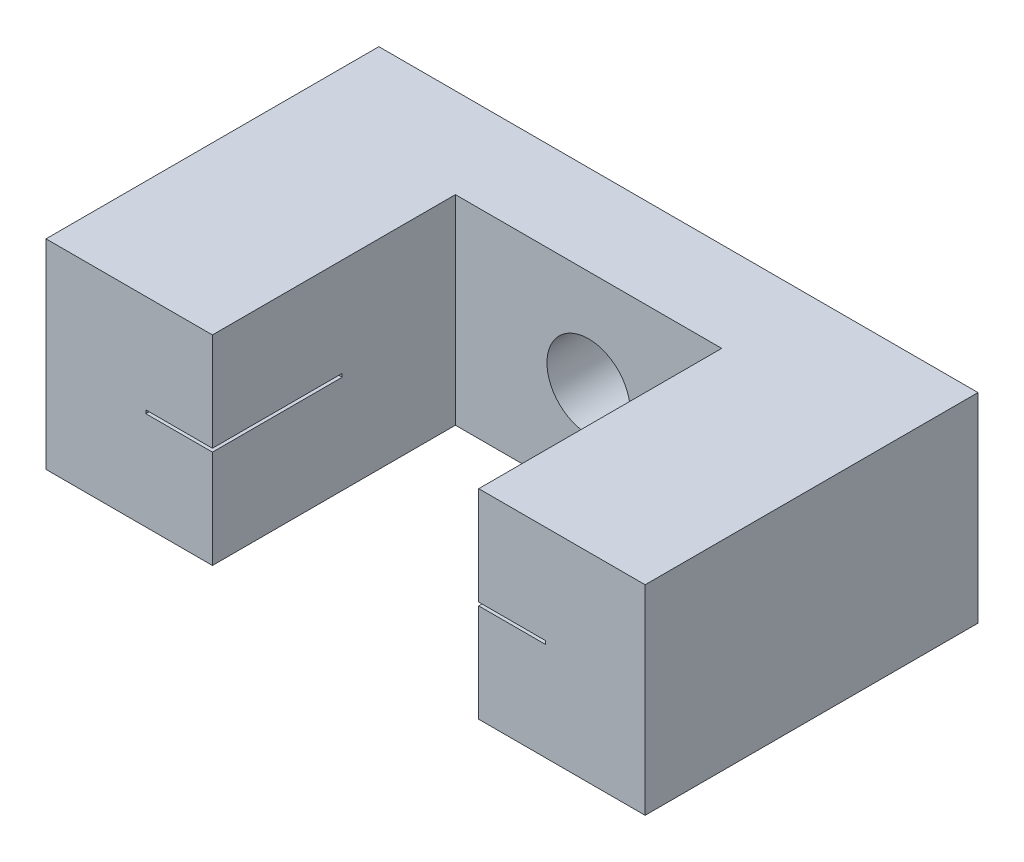
ISO-10303-21;
HEADER;
FILE_DESCRIPTION(('STEP AP214'),'2;1');
FILE_NAME('part.step','',(''),(''),'','','');
FILE_SCHEMA(('AUTOMOTIVE_DESIGN { 1 0 10303 214 1 1 1 1 }'));
ENDSEC;
DATA;
#1=APPLICATION_CONTEXT('core data for automotive mechanical design processes');
#2=APPLICATION_PROTOCOL_DEFINITION('international standard','automotive_design',2000,#1);
#3=PRODUCT_CONTEXT('',#1,'mechanical');
#4=PRODUCT('Part','Part','',(#3));
#5=PRODUCT_RELATED_PRODUCT_CATEGORY('part','',(#4));
#6=PRODUCT_DEFINITION_FORMATION('','',#4);
#7=PRODUCT_DEFINITION_CONTEXT('part definition',#1,'design');
#8=PRODUCT_DEFINITION('design','',#6,#7);
#9=PRODUCT_DEFINITION_SHAPE('','',#8);
#10=(LENGTH_UNIT() NAMED_UNIT(*) SI_UNIT(.MILLI.,.METRE.));
#11=(NAMED_UNIT(*) PLANE_ANGLE_UNIT() SI_UNIT($,.RADIAN.));
#12=(NAMED_UNIT(*) SI_UNIT($,.STERADIAN.) SOLID_ANGLE_UNIT());
#13=UNCERTAINTY_MEASURE_WITH_UNIT(LENGTH_MEASURE(1.E-05),#10,'distance_accuracy_value','');
#14=(GEOMETRIC_REPRESENTATION_CONTEXT(3) GLOBAL_UNCERTAINTY_ASSIGNED_CONTEXT((#13)) GLOBAL_UNIT_ASSIGNED_CONTEXT((#10,
#11,#12)) REPRESENTATION_CONTEXT('',''));
#15=CARTESIAN_POINT('',(0.,0.,0.));
#16=DIRECTION('',(0.,0.,1.));
#17=DIRECTION('',(1.,0.,0.));
#18=AXIS2_PLACEMENT_3D('',#15,#16,#17);
#19=CARTESIAN_POINT('',(0.,6.,0.));
#20=DIRECTION('',(0.,0.,-1.));
#21=DIRECTION('',(-1.,0.,0.));
#22=AXIS2_PLACEMENT_3D('',#19,#20,#21);
#23=PLANE('',#22);
#24=DIRECTION('',(0.,-1.,0.));
#25=VECTOR('',#24,1.);
#26=CARTESIAN_POINT('',(3.5,4.,0.));
#27=LINE('',#26,#25);
#28=CARTESIAN_POINT('',(3.5,4.,0.));
#29=VERTEX_POINT('',#28);
#30=CARTESIAN_POINT('',(3.5,2.,0.));
#31=VERTEX_POINT('',#30);
#32=EDGE_CURVE('E266',#29,#31,#27,.T.);
#33=ORIENTED_EDGE('',*,*,#32,.F.);
#34=DIRECTION('',(1.,0.,0.));
#35=VECTOR('',#34,1.);
#36=CARTESIAN_POINT('',(3.5,4.,0.));
#37=LINE('',#36,#35);
#38=CARTESIAN_POINT('',(1.5,4.,0.));
#39=VERTEX_POINT('',#38);
#40=EDGE_CURVE('E288',#39,#29,#37,.T.);
#41=ORIENTED_EDGE('',*,*,#40,.F.);
#42=DIRECTION('',(0.,1.,0.));
#43=VECTOR('',#42,1.);
#44=CARTESIAN_POINT('',(1.5,4.,0.));
#45=LINE('',#44,#43);
#46=CARTESIAN_POINT('',(1.5,2.,0.));
#47=VERTEX_POINT('',#46);
#48=EDGE_CURVE('E285',#47,#39,#45,.T.);
#49=ORIENTED_EDGE('',*,*,#48,.F.);
#50=DIRECTION('',(-1.,0.,0.));
#51=VECTOR('',#50,1.);
#52=CARTESIAN_POINT('',(3.5,2.,0.));
#53=LINE('',#52,#51);
#54=EDGE_CURVE('E282',#31,#47,#53,.T.);
#55=ORIENTED_EDGE('',*,*,#54,.F.);
#56=EDGE_LOOP('',(#33,#41,#49,#55));
#57=FACE_BOUND('',#56,.T.);
#58=CARTESIAN_POINT('',(9.,3.,0.));
#59=DIRECTION('',(0.,0.,-1.));
#60=DIRECTION('',(-1.,0.,0.));
#61=AXIS2_PLACEMENT_3D('',#58,#59,#60);
#62=CIRCLE('',#61,1.25);
#63=CARTESIAN_POINT('',(7.75,3.,0.));
#64=VERTEX_POINT('',#63);
#65=EDGE_CURVE('E365',#64,#64,#62,.F.);
#66=ORIENTED_EDGE('',*,*,#65,.T.);
#67=EDGE_LOOP('',(#66));
#68=FACE_BOUND('',#67,.T.);
#69=DIRECTION('',(1.,0.,0.));
#70=VECTOR('',#69,1.);
#71=CARTESIAN_POINT('',(0.,0.,0.));
#72=LINE('',#71,#70);
#73=CARTESIAN_POINT('',(0.,0.,0.));
#74=VERTEX_POINT('',#73);
#75=CARTESIAN_POINT('',(18.,0.,0.));
#76=VERTEX_POINT('',#75);
#77=EDGE_CURVE('E397',#74,#76,#72,.T.);
#78=ORIENTED_EDGE('',*,*,#77,.F.);
#79=DIRECTION('',(0.,-1.,0.));
#80=VECTOR('',#79,1.);
#81=CARTESIAN_POINT('',(0.,6.,0.));
#82=LINE('',#81,#80);
#83=CARTESIAN_POINT('',(0.,6.,0.));
#84=VERTEX_POINT('',#83);
#85=EDGE_CURVE('E394',#84,#74,#82,.T.);
#86=ORIENTED_EDGE('',*,*,#85,.F.);
#87=DIRECTION('',(1.,0.,0.));
#88=VECTOR('',#87,1.);
#89=CARTESIAN_POINT('',(0.,6.,0.));
#90=LINE('',#89,#88);
#91=CARTESIAN_POINT('',(18.,6.,0.));
#92=VERTEX_POINT('',#91);
#93=EDGE_CURVE('E372',#84,#92,#90,.T.);
#94=ORIENTED_EDGE('',*,*,#93,.T.);
#95=DIRECTION('',(0.,-1.,0.));
#96=VECTOR('',#95,1.);
#97=CARTESIAN_POINT('',(18.,6.,0.));
#98=LINE('',#97,#96);
#99=EDGE_CURVE('E434',#92,#76,#98,.T.);
#100=ORIENTED_EDGE('',*,*,#99,.T.);
#101=EDGE_LOOP('',(#78,#86,#94,#100));
#102=FACE_BOUND('',#101,.T.);
#103=DIRECTION('',(-1.,0.,0.));
#104=VECTOR('',#103,1.);
#105=CARTESIAN_POINT('',(14.5,4.,0.));
#106=LINE('',#105,#104);
#107=CARTESIAN_POINT('',(16.5,4.,0.));
#108=VERTEX_POINT('',#107);
#109=CARTESIAN_POINT('',(14.5,4.,0.));
#110=VERTEX_POINT('',#109);
#111=EDGE_CURVE('E247',#108,#110,#106,.T.);
#112=ORIENTED_EDGE('',*,*,#111,.T.);
#113=DIRECTION('',(0.,-1.,0.));
#114=VECTOR('',#113,1.);
#115=CARTESIAN_POINT('',(14.5,4.,0.));
#116=LINE('',#115,#114);
#117=CARTESIAN_POINT('',(14.5,2.,0.));
#118=VERTEX_POINT('',#117);
#119=EDGE_CURVE('E49',#110,#118,#116,.T.);
#120=ORIENTED_EDGE('',*,*,#119,.T.);
#121=DIRECTION('',(1.,0.,0.));
#122=VECTOR('',#121,1.);
#123=CARTESIAN_POINT('',(14.5,2.,0.));
#124=LINE('',#123,#122);
#125=CARTESIAN_POINT('',(16.5,2.,0.));
#126=VERTEX_POINT('',#125);
#127=EDGE_CURVE('E242',#118,#126,#124,.T.);
#128=ORIENTED_EDGE('',*,*,#127,.T.);
#129=DIRECTION('',(0.,1.,0.));
#130=VECTOR('',#129,1.);
#131=CARTESIAN_POINT('',(16.5,4.,0.));
#132=LINE('',#131,#130);
#133=EDGE_CURVE('E249',#126,#108,#132,.T.);
#134=ORIENTED_EDGE('',*,*,#133,.T.);
#135=EDGE_LOOP('',(#112,#120,#128,#134));
#136=FACE_BOUND('',#135,.T.);
#137=ADVANCED_FACE('F34',(#57,#68,#102,#136),#23,.T.);
#138=CARTESIAN_POINT('',(15.,2.95,10.));
#139=DIRECTION('',(0.,1.,0.));
#140=DIRECTION('',(0.,0.,1.));
#141=AXIS2_PLACEMENT_3D('',#138,#139,#140);
#142=PLANE('',#141);
#143=DIRECTION('',(-1.,0.,0.));
#144=VECTOR('',#143,1.);
#145=CARTESIAN_POINT('',(15.,2.95,8.));
#146=LINE('',#145,#144);
#147=CARTESIAN_POINT('',(15.,2.95,8.));
#148=VERTEX_POINT('',#147);
#149=CARTESIAN_POINT('',(14.5,2.95,8.));
#150=VERTEX_POINT('',#149);
#151=EDGE_CURVE('E57',#148,#150,#146,.T.);
#152=ORIENTED_EDGE('',*,*,#151,.T.);
#153=DIRECTION('',(0.,0.,-1.));
#154=VECTOR('',#153,1.);
#155=CARTESIAN_POINT('',(14.5,2.95,10.));
#156=LINE('',#155,#154);
#157=CARTESIAN_POINT('',(14.5,2.95,6.1));
#158=VERTEX_POINT('',#157);
#159=EDGE_CURVE('E263',#150,#158,#156,.T.);
#160=ORIENTED_EDGE('',*,*,#159,.T.);
#161=DIRECTION('',(-1.,0.,0.));
#162=VECTOR('',#161,1.);
#163=CARTESIAN_POINT('',(15.,2.95,6.1));
#164=LINE('',#163,#162);
#165=CARTESIAN_POINT('',(13.,2.95,6.1));
#166=VERTEX_POINT('',#165);
#167=EDGE_CURVE('E331',#158,#166,#164,.T.);
#168=ORIENTED_EDGE('',*,*,#167,.T.);
#169=DIRECTION('',(0.,0.,-1.));
#170=VECTOR('',#169,1.);
#171=CARTESIAN_POINT('',(13.,2.95,10.));
#172=LINE('',#171,#170);
#173=CARTESIAN_POINT('',(13.,2.95,10.));
#174=VERTEX_POINT('',#173);
#175=EDGE_CURVE('E313',#174,#166,#172,.T.);
#176=ORIENTED_EDGE('',*,*,#175,.F.);
#177=DIRECTION('',(-1.,0.,0.));
#178=VECTOR('',#177,1.);
#179=CARTESIAN_POINT('',(15.,2.95,10.));
#180=LINE('',#179,#178);
#181=CARTESIAN_POINT('',(15.,2.95,10.));
#182=VERTEX_POINT('',#181);
#183=EDGE_CURVE('E327',#182,#174,#180,.T.);
#184=ORIENTED_EDGE('',*,*,#183,.F.);
#185=DIRECTION('',(0.,0.,-1.));
#186=VECTOR('',#185,1.);
#187=CARTESIAN_POINT('',(15.,2.95,10.));
#188=LINE('',#187,#186);
#189=EDGE_CURVE('E316',#182,#148,#188,.T.);
#190=ORIENTED_EDGE('',*,*,#189,.T.);
#191=EDGE_LOOP('',(#152,#160,#168,#176,#184,#190));
#192=FACE_BOUND('',#191,.T.);
#193=ADVANCED_FACE('F446',(#192),#142,.T.);
#194=CARTESIAN_POINT('',(15.,3.05,6.1));
#195=DIRECTION('',(0.,0.,-1.));
#196=DIRECTION('',(-1.,0.,0.));
#197=AXIS2_PLACEMENT_3D('',#194,#195,#196);
#198=PLANE('',#197);
#199=DIRECTION('',(0.,-1.,0.));
#200=VECTOR('',#199,1.);
#201=CARTESIAN_POINT('',(14.5,3.05,6.1));
#202=LINE('',#201,#200);
#203=CARTESIAN_POINT('',(14.5,3.05,6.1));
#204=VERTEX_POINT('',#203);
#205=EDGE_CURVE('E261',#204,#158,#202,.T.);
#206=ORIENTED_EDGE('',*,*,#205,.F.);
#207=DIRECTION('',(-1.,0.,0.));
#208=VECTOR('',#207,1.);
#209=CARTESIAN_POINT('',(15.,3.05,6.1));
#210=LINE('',#209,#208);
#211=CARTESIAN_POINT('',(13.,3.05,6.1));
#212=VERTEX_POINT('',#211);
#213=EDGE_CURVE('E333',#204,#212,#210,.T.);
#214=ORIENTED_EDGE('',*,*,#213,.T.);
#215=DIRECTION('',(0.,-1.,0.));
#216=VECTOR('',#215,1.);
#217=CARTESIAN_POINT('',(13.,3.05,6.1));
#218=LINE('',#217,#216);
#219=EDGE_CURVE('E322',#212,#166,#218,.T.);
#220=ORIENTED_EDGE('',*,*,#219,.T.);
#221=ORIENTED_EDGE('',*,*,#167,.F.);
#222=EDGE_LOOP('',(#206,#214,#220,#221));
#223=FACE_BOUND('',#222,.T.);
#224=ADVANCED_FACE('F538',(#223),#198,.F.);
#225=CARTESIAN_POINT('',(15.,3.05,10.));
#226=DIRECTION('',(0.,1.,0.));
#227=DIRECTION('',(0.,0.,1.));
#228=AXIS2_PLACEMENT_3D('',#225,#226,#227);
#229=PLANE('',#228);
#230=DIRECTION('',(0.,0.,-1.));
#231=VECTOR('',#230,1.);
#232=CARTESIAN_POINT('',(14.5,3.05,10.));
#233=LINE('',#232,#231);
#234=CARTESIAN_POINT('',(14.5,3.05,8.));
#235=VERTEX_POINT('',#234);
#236=EDGE_CURVE('E11',#235,#204,#233,.T.);
#237=ORIENTED_EDGE('',*,*,#236,.F.);
#238=DIRECTION('',(-1.,0.,0.));
#239=VECTOR('',#238,1.);
#240=CARTESIAN_POINT('',(15.,3.05,8.));
#241=LINE('',#240,#239);
#242=CARTESIAN_POINT('',(15.,3.05,8.));
#243=VERTEX_POINT('',#242);
#244=EDGE_CURVE('E239',#243,#235,#241,.T.);
#245=ORIENTED_EDGE('',*,*,#244,.F.);
#246=DIRECTION('',(0.,0.,-1.));
#247=VECTOR('',#246,1.);
#248=CARTESIAN_POINT('',(15.,3.05,10.));
#249=LINE('',#248,#247);
#250=CARTESIAN_POINT('',(15.,3.05,10.));
#251=VERTEX_POINT('',#250);
#252=EDGE_CURVE('E312',#251,#243,#249,.T.);
#253=ORIENTED_EDGE('',*,*,#252,.F.);
#254=DIRECTION('',(-1.,0.,0.));
#255=VECTOR('',#254,1.);
#256=CARTESIAN_POINT('',(15.,3.05,10.));
#257=LINE('',#256,#255);
#258=CARTESIAN_POINT('',(13.,3.05,10.));
#259=VERTEX_POINT('',#258);
#260=EDGE_CURVE('E319',#251,#259,#257,.T.);
#261=ORIENTED_EDGE('',*,*,#260,.T.);
#262=DIRECTION('',(0.,0.,-1.));
#263=VECTOR('',#262,1.);
#264=CARTESIAN_POINT('',(13.,3.05,10.));
#265=LINE('',#264,#263);
#266=EDGE_CURVE('E308',#259,#212,#265,.T.);
#267=ORIENTED_EDGE('',*,*,#266,.T.);
#268=ORIENTED_EDGE('',*,*,#213,.F.);
#269=EDGE_LOOP('',(#237,#245,#253,#261,#267,#268));
#270=FACE_BOUND('',#269,.T.);
#271=ADVANCED_FACE('F570',(#270),#229,.F.);
#272=CARTESIAN_POINT('',(15.,0.,0.));
#273=DIRECTION('',(-1.,0.,0.));
#274=DIRECTION('',(0.,0.,-1.));
#275=AXIS2_PLACEMENT_3D('',#272,#273,#274);
#276=PLANE('',#275);
#277=ORIENTED_EDGE('',*,*,#252,.T.);
#278=DIRECTION('',(0.,-1.,0.));
#279=VECTOR('',#278,1.);
#280=CARTESIAN_POINT('',(15.,0.,8.));
#281=LINE('',#280,#279);
#282=EDGE_CURVE('E42',#243,#148,#281,.T.);
#283=ORIENTED_EDGE('',*,*,#282,.T.);
#284=ORIENTED_EDGE('',*,*,#189,.F.);
#285=DIRECTION('',(0.,-1.,0.));
#286=VECTOR('',#285,1.);
#287=CARTESIAN_POINT('',(15.,3.05,10.));
#288=LINE('',#287,#286);
#289=EDGE_CURVE('E309',#251,#182,#288,.T.);
#290=ORIENTED_EDGE('',*,*,#289,.F.);
#291=EDGE_LOOP('',(#277,#283,#284,#290));
#292=FACE_BOUND('',#291,.T.);
#293=ADVANCED_FACE('F443',(#292),#276,.T.);
#294=CARTESIAN_POINT('',(3.,0.,0.));
#295=DIRECTION('',(1.,0.,0.));
#296=DIRECTION('',(0.,0.,-1.));
#297=AXIS2_PLACEMENT_3D('',#294,#295,#296);
#298=PLANE('',#297);
#299=DIRECTION('',(0.,0.,-1.));
#300=VECTOR('',#299,1.);
#301=CARTESIAN_POINT('',(3.,2.95,10.));
#302=LINE('',#301,#300);
#303=CARTESIAN_POINT('',(3.,2.95,10.));
#304=VERTEX_POINT('',#303);
#305=CARTESIAN_POINT('',(3.,2.95,8.));
#306=VERTEX_POINT('',#305);
#307=EDGE_CURVE('E339',#304,#306,#302,.T.);
#308=ORIENTED_EDGE('',*,*,#307,.T.);
#309=DIRECTION('',(0.,1.,0.));
#310=VECTOR('',#309,1.);
#311=CARTESIAN_POINT('',(3.,0.,8.));
#312=LINE('',#311,#310);
#313=CARTESIAN_POINT('',(3.,3.05,8.));
#314=VERTEX_POINT('',#313);
#315=EDGE_CURVE('E419',#306,#314,#312,.T.);
#316=ORIENTED_EDGE('',*,*,#315,.T.);
#317=DIRECTION('',(0.,0.,-1.));
#318=VECTOR('',#317,1.);
#319=CARTESIAN_POINT('',(3.,3.05,10.));
#320=LINE('',#319,#318);
#321=CARTESIAN_POINT('',(3.,3.05,10.));
#322=VERTEX_POINT('',#321);
#323=EDGE_CURVE('E343',#322,#314,#320,.T.);
#324=ORIENTED_EDGE('',*,*,#323,.F.);
#325=DIRECTION('',(0.,-1.,0.));
#326=VECTOR('',#325,1.);
#327=CARTESIAN_POINT('',(3.,3.05,10.));
#328=LINE('',#327,#326);
#329=EDGE_CURVE('E336',#322,#304,#328,.T.);
#330=ORIENTED_EDGE('',*,*,#329,.T.);
#331=EDGE_LOOP('',(#308,#316,#324,#330));
#332=FACE_BOUND('',#331,.T.);
#333=ADVANCED_FACE('F495',(#332),#298,.T.);
#334=CARTESIAN_POINT('',(13.,6.,10.));
#335=DIRECTION('',(-1.,0.,0.));
#336=DIRECTION('',(0.,0.,1.));
#337=AXIS2_PLACEMENT_3D('',#334,#335,#336);
#338=PLANE('',#337);
#339=DIRECTION('',(0.,-1.,0.));
#340=VECTOR('',#339,1.);
#341=CARTESIAN_POINT('',(13.,6.,10.));
#342=LINE('',#341,#340);
#343=CARTESIAN_POINT('',(13.,0.,10.));
#344=VERTEX_POINT('',#343);
#345=EDGE_CURVE('E431',#174,#344,#342,.T.);
#346=ORIENTED_EDGE('',*,*,#345,.F.);
#347=ORIENTED_EDGE('',*,*,#175,.T.);
#348=ORIENTED_EDGE('',*,*,#219,.F.);
#349=ORIENTED_EDGE('',*,*,#266,.F.);
#350=CARTESIAN_POINT('',(13.,6.,10.));
#351=VERTEX_POINT('',#350);
#352=EDGE_CURVE('E428',#351,#259,#342,.T.);
#353=ORIENTED_EDGE('',*,*,#352,.F.);
#354=DIRECTION('',(0.,0.,-1.));
#355=VECTOR('',#354,1.);
#356=CARTESIAN_POINT('',(13.,6.,10.));
#357=LINE('',#356,#355);
#358=CARTESIAN_POINT('',(13.,6.,2.7));
#359=VERTEX_POINT('',#358);
#360=EDGE_CURVE('E382',#351,#359,#357,.T.);
#361=ORIENTED_EDGE('',*,*,#360,.T.);
#362=DIRECTION('',(0.,-1.,0.));
#363=VECTOR('',#362,1.);
#364=CARTESIAN_POINT('',(13.,6.,2.7));
#365=LINE('',#364,#363);
#366=CARTESIAN_POINT('',(13.,0.,2.7));
#367=VERTEX_POINT('',#366);
#368=EDGE_CURVE('E426',#359,#367,#365,.T.);
#369=ORIENTED_EDGE('',*,*,#368,.T.);
#370=DIRECTION('',(0.,0.,-1.));
#371=VECTOR('',#370,1.);
#372=CARTESIAN_POINT('',(13.,0.,10.));
#373=LINE('',#372,#371);
#374=EDGE_CURVE('E406',#344,#367,#373,.T.);
#375=ORIENTED_EDGE('',*,*,#374,.F.);
#376=EDGE_LOOP('',(#346,#347,#348,#349,#353,#361,#369,#375));
#377=FACE_BOUND('',#376,.T.);
#378=ADVANCED_FACE('F454',(#377),#338,.T.);
#379=CARTESIAN_POINT('',(18.,6.,10.));
#380=DIRECTION('',(0.,0.,1.));
#381=DIRECTION('',(1.,0.,0.));
#382=AXIS2_PLACEMENT_3D('',#379,#380,#381);
#383=PLANE('',#382);
#384=ORIENTED_EDGE('',*,*,#289,.T.);
#385=ORIENTED_EDGE('',*,*,#183,.T.);
#386=ORIENTED_EDGE('',*,*,#345,.T.);
#387=DIRECTION('',(-1.,0.,0.));
#388=VECTOR('',#387,1.);
#389=CARTESIAN_POINT('',(18.,0.,10.));
#390=LINE('',#389,#388);
#391=CARTESIAN_POINT('',(18.,0.,10.));
#392=VERTEX_POINT('',#391);
#393=EDGE_CURVE('E403',#392,#344,#390,.T.);
#394=ORIENTED_EDGE('',*,*,#393,.F.);
#395=DIRECTION('',(0.,-1.,0.));
#396=VECTOR('',#395,1.);
#397=CARTESIAN_POINT('',(18.,6.,10.));
#398=LINE('',#397,#396);
#399=CARTESIAN_POINT('',(18.,6.,10.));
#400=VERTEX_POINT('',#399);
#401=EDGE_CURVE('E432',#400,#392,#398,.T.);
#402=ORIENTED_EDGE('',*,*,#401,.F.);
#403=DIRECTION('',(-1.,0.,0.));
#404=VECTOR('',#403,1.);
#405=CARTESIAN_POINT('',(18.,6.,10.));
#406=LINE('',#405,#404);
#407=EDGE_CURVE('E379',#400,#351,#406,.T.);
#408=ORIENTED_EDGE('',*,*,#407,.T.);
#409=ORIENTED_EDGE('',*,*,#352,.T.);
#410=ORIENTED_EDGE('',*,*,#260,.F.);
#411=EDGE_LOOP('',(#384,#385,#386,#394,#402,#408,#409,#410));
#412=FACE_BOUND('',#411,.T.);
#413=ADVANCED_FACE('F449',(#412),#383,.T.);
#414=CARTESIAN_POINT('',(5.,6.,10.));
#415=DIRECTION('',(0.,0.,1.));
#416=DIRECTION('',(1.,0.,0.));
#417=AXIS2_PLACEMENT_3D('',#414,#415,#416);
#418=PLANE('',#417);
#419=ORIENTED_EDGE('',*,*,#329,.F.);
#420=DIRECTION('',(1.,0.,0.));
#421=VECTOR('',#420,1.);
#422=CARTESIAN_POINT('',(3.,3.05,10.));
#423=LINE('',#422,#421);
#424=CARTESIAN_POINT('',(5.,3.05,10.));
#425=VERTEX_POINT('',#424);
#426=EDGE_CURVE('E354',#322,#425,#423,.T.);
#427=ORIENTED_EDGE('',*,*,#426,.T.);
#428=DIRECTION('',(0.,-1.,0.));
#429=VECTOR('',#428,1.);
#430=CARTESIAN_POINT('',(5.,6.,10.));
#431=LINE('',#430,#429);
#432=CARTESIAN_POINT('',(5.,6.,10.));
#433=VERTEX_POINT('',#432);
#434=EDGE_CURVE('E420',#433,#425,#431,.T.);
#435=ORIENTED_EDGE('',*,*,#434,.F.);
#436=DIRECTION('',(-1.,0.,0.));
#437=VECTOR('',#436,1.);
#438=CARTESIAN_POINT('',(5.,6.,10.));
#439=LINE('',#438,#437);
#440=CARTESIAN_POINT('',(0.,6.,10.));
#441=VERTEX_POINT('',#440);
#442=EDGE_CURVE('E391',#433,#441,#439,.T.);
#443=ORIENTED_EDGE('',*,*,#442,.T.);
#444=DIRECTION('',(0.,-1.,0.));
#445=VECTOR('',#444,1.);
#446=CARTESIAN_POINT('',(0.,6.,10.));
#447=LINE('',#446,#445);
#448=CARTESIAN_POINT('',(0.,0.,10.));
#449=VERTEX_POINT('',#448);
#450=EDGE_CURVE('E417',#441,#449,#447,.T.);
#451=ORIENTED_EDGE('',*,*,#450,.T.);
#452=DIRECTION('',(-1.,0.,0.));
#453=VECTOR('',#452,1.);
#454=CARTESIAN_POINT('',(5.,0.,10.));
#455=LINE('',#454,#453);
#456=CARTESIAN_POINT('',(5.,0.,10.));
#457=VERTEX_POINT('',#456);
#458=EDGE_CURVE('E373',#457,#449,#455,.T.);
#459=ORIENTED_EDGE('',*,*,#458,.F.);
#460=CARTESIAN_POINT('',(5.,2.95,10.));
#461=VERTEX_POINT('',#460);
#462=EDGE_CURVE('E423',#461,#457,#431,.T.);
#463=ORIENTED_EDGE('',*,*,#462,.F.);
#464=DIRECTION('',(1.,0.,0.));
#465=VECTOR('',#464,1.);
#466=CARTESIAN_POINT('',(3.,2.95,10.));
#467=LINE('',#466,#465);
#468=EDGE_CURVE('E346',#304,#461,#467,.T.);
#469=ORIENTED_EDGE('',*,*,#468,.F.);
#470=EDGE_LOOP('',(#419,#427,#435,#443,#451,#459,#463,#469));
#471=FACE_BOUND('',#470,.T.);
#472=ADVANCED_FACE('F479',(#471),#418,.T.);
#473=CARTESIAN_POINT('',(5.,6.,2.7));
#474=DIRECTION('',(1.,0.,0.));
#475=DIRECTION('',(0.,0.,-1.));
#476=AXIS2_PLACEMENT_3D('',#473,#474,#475);
#477=PLANE('',#476);
#478=ORIENTED_EDGE('',*,*,#434,.T.);
#479=DIRECTION('',(0.,0.,-1.));
#480=VECTOR('',#479,1.);
#481=CARTESIAN_POINT('',(5.,3.05,10.));
#482=LINE('',#481,#480);
#483=CARTESIAN_POINT('',(5.,3.05,6.1));
#484=VERTEX_POINT('',#483);
#485=EDGE_CURVE('E340',#425,#484,#482,.T.);
#486=ORIENTED_EDGE('',*,*,#485,.T.);
#487=DIRECTION('',(0.,-1.,0.));
#488=VECTOR('',#487,1.);
#489=CARTESIAN_POINT('',(5.,3.05,6.1));
#490=LINE('',#489,#488);
#491=CARTESIAN_POINT('',(5.,2.95,6.1));
#492=VERTEX_POINT('',#491);
#493=EDGE_CURVE('E349',#484,#492,#490,.T.);
#494=ORIENTED_EDGE('',*,*,#493,.T.);
#495=DIRECTION('',(0.,0.,-1.));
#496=VECTOR('',#495,1.);
#497=CARTESIAN_POINT('',(5.,2.95,10.));
#498=LINE('',#497,#496);
#499=EDGE_CURVE('E330',#461,#492,#498,.T.);
#500=ORIENTED_EDGE('',*,*,#499,.F.);
#501=ORIENTED_EDGE('',*,*,#462,.T.);
#502=DIRECTION('',(0.,0.,1.));
#503=VECTOR('',#502,1.);
#504=CARTESIAN_POINT('',(5.,0.,2.7));
#505=LINE('',#504,#503);
#506=CARTESIAN_POINT('',(5.,0.,2.7));
#507=VERTEX_POINT('',#506);
#508=EDGE_CURVE('E412',#507,#457,#505,.T.);
#509=ORIENTED_EDGE('',*,*,#508,.F.);
#510=DIRECTION('',(0.,-1.,0.));
#511=VECTOR('',#510,1.);
#512=CARTESIAN_POINT('',(5.,6.,2.7));
#513=LINE('',#512,#511);
#514=CARTESIAN_POINT('',(5.,6.,2.7));
#515=VERTEX_POINT('',#514);
#516=EDGE_CURVE('E424',#515,#507,#513,.T.);
#517=ORIENTED_EDGE('',*,*,#516,.F.);
#518=DIRECTION('',(0.,0.,1.));
#519=VECTOR('',#518,1.);
#520=CARTESIAN_POINT('',(5.,6.,2.7));
#521=LINE('',#520,#519);
#522=EDGE_CURVE('E388',#515,#433,#521,.T.);
#523=ORIENTED_EDGE('',*,*,#522,.T.);
#524=EDGE_LOOP('',(#478,#486,#494,#500,#501,#509,#517,#523));
#525=FACE_BOUND('',#524,.T.);
#526=ADVANCED_FACE('F486',(#525),#477,.T.);
#527=CARTESIAN_POINT('',(0.,6.,10.));
#528=DIRECTION('',(-1.,0.,0.));
#529=DIRECTION('',(0.,0.,1.));
#530=AXIS2_PLACEMENT_3D('',#527,#528,#529);
#531=PLANE('',#530);
#532=DIRECTION('',(0.,0.,-1.));
#533=VECTOR('',#532,1.);
#534=CARTESIAN_POINT('',(0.,0.,10.));
#535=LINE('',#534,#533);
#536=EDGE_CURVE('E368',#449,#74,#535,.T.);
#537=ORIENTED_EDGE('',*,*,#536,.F.);
#538=ORIENTED_EDGE('',*,*,#450,.F.);
#539=DIRECTION('',(0.,0.,-1.));
#540=VECTOR('',#539,1.);
#541=CARTESIAN_POINT('',(0.,6.,10.));
#542=LINE('',#541,#540);
#543=EDGE_CURVE('E369',#441,#84,#542,.T.);
#544=ORIENTED_EDGE('',*,*,#543,.T.);
#545=ORIENTED_EDGE('',*,*,#85,.T.);
#546=EDGE_LOOP('',(#537,#538,#544,#545));
#547=FACE_BOUND('',#546,.T.);
#548=ADVANCED_FACE('F36',(#547),#531,.T.);
#549=CARTESIAN_POINT('',(13.,6.,2.7));
#550=DIRECTION('',(0.,0.,1.));
#551=DIRECTION('',(1.,0.,0.));
#552=AXIS2_PLACEMENT_3D('',#549,#550,#551);
#553=PLANE('',#552);
#554=CARTESIAN_POINT('',(9.,3.,2.7));
#555=DIRECTION('',(0.,0.,1.));
#556=DIRECTION('',(1.,0.,0.));
#557=AXIS2_PLACEMENT_3D('',#554,#555,#556);
#558=CIRCLE('',#557,1.25);
#559=CARTESIAN_POINT('',(10.25,3.,2.7));
#560=VERTEX_POINT('',#559);
#561=EDGE_CURVE('E357',#560,#560,#558,.T.);
#562=ORIENTED_EDGE('',*,*,#561,.F.);
#563=EDGE_LOOP('',(#562));
#564=FACE_BOUND('',#563,.T.);
#565=DIRECTION('',(-1.,0.,0.));
#566=VECTOR('',#565,1.);
#567=CARTESIAN_POINT('',(13.,0.,2.7));
#568=LINE('',#567,#566);
#569=EDGE_CURVE('E409',#367,#507,#568,.T.);
#570=ORIENTED_EDGE('',*,*,#569,.F.);
#571=ORIENTED_EDGE('',*,*,#368,.F.);
#572=DIRECTION('',(-1.,0.,0.));
#573=VECTOR('',#572,1.);
#574=CARTESIAN_POINT('',(13.,6.,2.7));
#575=LINE('',#574,#573);
#576=EDGE_CURVE('E385',#359,#515,#575,.T.);
#577=ORIENTED_EDGE('',*,*,#576,.T.);
#578=ORIENTED_EDGE('',*,*,#516,.T.);
#579=EDGE_LOOP('',(#570,#571,#577,#578));
#580=FACE_BOUND('',#579,.T.);
#581=ADVANCED_FACE('F484',(#564,#580),#553,.T.);
#582=CARTESIAN_POINT('',(18.,6.,0.));
#583=DIRECTION('',(1.,0.,0.));
#584=DIRECTION('',(0.,0.,-1.));
#585=AXIS2_PLACEMENT_3D('',#582,#583,#584);
#586=PLANE('',#585);
#587=DIRECTION('',(0.,0.,1.));
#588=VECTOR('',#587,1.);
#589=CARTESIAN_POINT('',(18.,0.,0.));
#590=LINE('',#589,#588);
#591=EDGE_CURVE('E400',#76,#392,#590,.T.);
#592=ORIENTED_EDGE('',*,*,#591,.F.);
#593=ORIENTED_EDGE('',*,*,#99,.F.);
#594=DIRECTION('',(0.,0.,1.));
#595=VECTOR('',#594,1.);
#596=CARTESIAN_POINT('',(18.,6.,0.));
#597=LINE('',#596,#595);
#598=EDGE_CURVE('E376',#92,#400,#597,.T.);
#599=ORIENTED_EDGE('',*,*,#598,.T.);
#600=ORIENTED_EDGE('',*,*,#401,.T.);
#601=EDGE_LOOP('',(#592,#593,#599,#600));
#602=FACE_BOUND('',#601,.T.);
#603=ADVANCED_FACE('F469',(#602),#586,.T.);
#604=CARTESIAN_POINT('',(0.,6.,0.));
#605=DIRECTION('',(0.,-1.,0.));
#606=DIRECTION('',(0.,0.,-1.));
#607=AXIS2_PLACEMENT_3D('',#604,#605,#606);
#608=PLANE('',#607);
#609=ORIENTED_EDGE('',*,*,#543,.F.);
#610=ORIENTED_EDGE('',*,*,#442,.F.);
#611=ORIENTED_EDGE('',*,*,#522,.F.);
#612=ORIENTED_EDGE('',*,*,#576,.F.);
#613=ORIENTED_EDGE('',*,*,#360,.F.);
#614=ORIENTED_EDGE('',*,*,#407,.F.);
#615=ORIENTED_EDGE('',*,*,#598,.F.);
#616=ORIENTED_EDGE('',*,*,#93,.F.);
#617=EDGE_LOOP('',(#609,#610,#611,#612,#613,#614,#615,#616));
#618=FACE_BOUND('',#617,.T.);
#619=ADVANCED_FACE('F466',(#618),#608,.F.);
#620=CARTESIAN_POINT('',(0.,0.,0.));
#621=DIRECTION('',(0.,-1.,0.));
#622=DIRECTION('',(0.,0.,-1.));
#623=AXIS2_PLACEMENT_3D('',#620,#621,#622);
#624=PLANE('',#623);
#625=ORIENTED_EDGE('',*,*,#536,.T.);
#626=ORIENTED_EDGE('',*,*,#77,.T.);
#627=ORIENTED_EDGE('',*,*,#591,.T.);
#628=ORIENTED_EDGE('',*,*,#393,.T.);
#629=ORIENTED_EDGE('',*,*,#374,.T.);
#630=ORIENTED_EDGE('',*,*,#569,.T.);
#631=ORIENTED_EDGE('',*,*,#508,.T.);
#632=ORIENTED_EDGE('',*,*,#458,.T.);
#633=EDGE_LOOP('',(#625,#626,#627,#628,#629,#630,#631,#632));
#634=FACE_BOUND('',#633,.T.);
#635=ADVANCED_FACE('F458',(#634),#624,.T.);
#636=CARTESIAN_POINT('',(9.,3.,-3.53553390593274));
#637=DIRECTION('',(0.,0.,1.));
#638=DIRECTION('',(1.,0.,0.));
#639=AXIS2_PLACEMENT_3D('',#636,#637,#638);
#640=CYLINDRICAL_SURFACE('',#639,1.25);
#641=ORIENTED_EDGE('',*,*,#561,.T.);
#642=EDGE_LOOP('',(#641));
#643=FACE_BOUND('',#642,.T.);
#644=ORIENTED_EDGE('',*,*,#65,.F.);
#645=EDGE_LOOP('',(#644));
#646=FACE_BOUND('',#645,.T.);
#647=ADVANCED_FACE('F556',(#643,#646),#640,.F.);
#648=CARTESIAN_POINT('',(3.,3.05,10.));
#649=DIRECTION('',(0.,-1.,0.));
#650=DIRECTION('',(0.,0.,-1.));
#651=AXIS2_PLACEMENT_3D('',#648,#649,#650);
#652=PLANE('',#651);
#653=DIRECTION('',(0.,0.,1.));
#654=VECTOR('',#653,1.);
#655=CARTESIAN_POINT('',(3.5,3.05,10.));
#656=LINE('',#655,#654);
#657=CARTESIAN_POINT('',(3.5,3.05,6.1));
#658=VERTEX_POINT('',#657);
#659=CARTESIAN_POINT('',(3.5,3.05,8.));
#660=VERTEX_POINT('',#659);
#661=EDGE_CURVE('E306',#658,#660,#656,.T.);
#662=ORIENTED_EDGE('',*,*,#661,.F.);
#663=DIRECTION('',(1.,0.,0.));
#664=VECTOR('',#663,1.);
#665=CARTESIAN_POINT('',(3.,3.05,6.1));
#666=LINE('',#665,#664);
#667=EDGE_CURVE('E358',#658,#484,#666,.T.);
#668=ORIENTED_EDGE('',*,*,#667,.T.);
#669=ORIENTED_EDGE('',*,*,#485,.F.);
#670=ORIENTED_EDGE('',*,*,#426,.F.);
#671=ORIENTED_EDGE('',*,*,#323,.T.);
#672=DIRECTION('',(1.,0.,0.));
#673=VECTOR('',#672,1.);
#674=CARTESIAN_POINT('',(3.,3.05,8.));
#675=LINE('',#674,#673);
#676=EDGE_CURVE('E301',#314,#660,#675,.T.);
#677=ORIENTED_EDGE('',*,*,#676,.T.);
#678=EDGE_LOOP('',(#662,#668,#669,#670,#671,#677));
#679=FACE_BOUND('',#678,.T.);
#680=ADVANCED_FACE('F498',(#679),#652,.T.);
#681=CARTESIAN_POINT('',(3.,3.05,6.1));
#682=DIRECTION('',(0.,0.,1.));
#683=DIRECTION('',(1.,0.,0.));
#684=AXIS2_PLACEMENT_3D('',#681,#682,#683);
#685=PLANE('',#684);
#686=DIRECTION('',(0.,1.,0.));
#687=VECTOR('',#686,1.);
#688=CARTESIAN_POINT('',(3.5,3.05,6.1));
#689=LINE('',#688,#687);
#690=CARTESIAN_POINT('',(3.5,2.95,6.1));
#691=VERTEX_POINT('',#690);
#692=EDGE_CURVE('E304',#691,#658,#689,.T.);
#693=ORIENTED_EDGE('',*,*,#692,.F.);
#694=DIRECTION('',(1.,0.,0.));
#695=VECTOR('',#694,1.);
#696=CARTESIAN_POINT('',(3.,2.95,6.1));
#697=LINE('',#696,#695);
#698=EDGE_CURVE('E360',#691,#492,#697,.T.);
#699=ORIENTED_EDGE('',*,*,#698,.T.);
#700=ORIENTED_EDGE('',*,*,#493,.F.);
#701=ORIENTED_EDGE('',*,*,#667,.F.);
#702=EDGE_LOOP('',(#693,#699,#700,#701));
#703=FACE_BOUND('',#702,.T.);
#704=ADVANCED_FACE('F503',(#703),#685,.T.);
#705=CARTESIAN_POINT('',(3.,2.95,10.));
#706=DIRECTION('',(0.,-1.,0.));
#707=DIRECTION('',(0.,0.,-1.));
#708=AXIS2_PLACEMENT_3D('',#705,#706,#707);
#709=PLANE('',#708);
#710=ORIENTED_EDGE('',*,*,#698,.F.);
#711=DIRECTION('',(0.,0.,1.));
#712=VECTOR('',#711,1.);
#713=CARTESIAN_POINT('',(3.5,2.95,10.));
#714=LINE('',#713,#712);
#715=CARTESIAN_POINT('',(3.5,2.95,8.));
#716=VERTEX_POINT('',#715);
#717=EDGE_CURVE('E439',#691,#716,#714,.T.);
#718=ORIENTED_EDGE('',*,*,#717,.T.);
#719=DIRECTION('',(1.,0.,0.));
#720=VECTOR('',#719,1.);
#721=CARTESIAN_POINT('',(3.,2.95,8.));
#722=LINE('',#721,#720);
#723=EDGE_CURVE('E293',#306,#716,#722,.T.);
#724=ORIENTED_EDGE('',*,*,#723,.F.);
#725=ORIENTED_EDGE('',*,*,#307,.F.);
#726=ORIENTED_EDGE('',*,*,#468,.T.);
#727=ORIENTED_EDGE('',*,*,#499,.T.);
#728=EDGE_LOOP('',(#710,#718,#724,#725,#726,#727));
#729=FACE_BOUND('',#728,.T.);
#730=ADVANCED_FACE('F491',(#729),#709,.F.);
#731=CARTESIAN_POINT('',(3.5,4.,8.));
#732=DIRECTION('',(1.,0.,0.));
#733=DIRECTION('',(0.,1.,0.));
#734=AXIS2_PLACEMENT_3D('',#731,#732,#733);
#735=PLANE('',#734);
#736=ORIENTED_EDGE('',*,*,#661,.T.);
#737=DIRECTION('',(0.,-1.,0.));
#738=VECTOR('',#737,1.);
#739=CARTESIAN_POINT('',(3.5,4.,8.));
#740=LINE('',#739,#738);
#741=CARTESIAN_POINT('',(3.5,4.,8.));
#742=VERTEX_POINT('',#741);
#743=EDGE_CURVE('E267',#742,#660,#740,.T.);
#744=ORIENTED_EDGE('',*,*,#743,.F.);
#745=DIRECTION('',(0.,0.,-1.));
#746=VECTOR('',#745,1.);
#747=CARTESIAN_POINT('',(3.5,4.,8.));
#748=LINE('',#747,#746);
#749=EDGE_CURVE('E291',#742,#29,#748,.T.);
#750=ORIENTED_EDGE('',*,*,#749,.T.);
#751=ORIENTED_EDGE('',*,*,#32,.T.);
#752=DIRECTION('',(0.,0.,-1.));
#753=VECTOR('',#752,1.);
#754=CARTESIAN_POINT('',(3.5,2.,8.));
#755=LINE('',#754,#753);
#756=CARTESIAN_POINT('',(3.5,2.,8.));
#757=VERTEX_POINT('',#756);
#758=EDGE_CURVE('E280',#757,#31,#755,.T.);
#759=ORIENTED_EDGE('',*,*,#758,.F.);
#760=EDGE_CURVE('E271',#716,#757,#740,.T.);
#761=ORIENTED_EDGE('',*,*,#760,.F.);
#762=ORIENTED_EDGE('',*,*,#717,.F.);
#763=ORIENTED_EDGE('',*,*,#692,.T.);
#764=EDGE_LOOP('',(#736,#744,#750,#751,#759,#761,#762,#763));
#765=FACE_BOUND('',#764,.T.);
#766=ADVANCED_FACE('F506',(#765),#735,.F.);
#767=CARTESIAN_POINT('',(3.5,4.,8.));
#768=DIRECTION('',(0.,1.,0.));
#769=DIRECTION('',(0.,0.,1.));
#770=AXIS2_PLACEMENT_3D('',#767,#768,#769);
#771=PLANE('',#770);
#772=ORIENTED_EDGE('',*,*,#40,.T.);
#773=ORIENTED_EDGE('',*,*,#749,.F.);
#774=DIRECTION('',(1.,0.,0.));
#775=VECTOR('',#774,1.);
#776=CARTESIAN_POINT('',(3.5,4.,8.));
#777=LINE('',#776,#775);
#778=CARTESIAN_POINT('',(1.5,4.,8.));
#779=VERTEX_POINT('',#778);
#780=EDGE_CURVE('E277',#779,#742,#777,.T.);
#781=ORIENTED_EDGE('',*,*,#780,.F.);
#782=DIRECTION('',(0.,0.,-1.));
#783=VECTOR('',#782,1.);
#784=CARTESIAN_POINT('',(1.5,4.,8.));
#785=LINE('',#784,#783);
#786=EDGE_CURVE('E294',#779,#39,#785,.T.);
#787=ORIENTED_EDGE('',*,*,#786,.T.);
#788=EDGE_LOOP('',(#772,#773,#781,#787));
#789=FACE_BOUND('',#788,.T.);
#790=ADVANCED_FACE('F516',(#789),#771,.F.);
#791=CARTESIAN_POINT('',(1.5,4.,8.));
#792=DIRECTION('',(-1.,0.,0.));
#793=DIRECTION('',(0.,-1.,0.));
#794=AXIS2_PLACEMENT_3D('',#791,#792,#793);
#795=PLANE('',#794);
#796=ORIENTED_EDGE('',*,*,#48,.T.);
#797=ORIENTED_EDGE('',*,*,#786,.F.);
#798=DIRECTION('',(0.,1.,0.));
#799=VECTOR('',#798,1.);
#800=CARTESIAN_POINT('',(1.5,4.,8.));
#801=LINE('',#800,#799);
#802=CARTESIAN_POINT('',(1.5,2.,8.));
#803=VERTEX_POINT('',#802);
#804=EDGE_CURVE('E274',#803,#779,#801,.T.);
#805=ORIENTED_EDGE('',*,*,#804,.F.);
#806=DIRECTION('',(0.,0.,-1.));
#807=VECTOR('',#806,1.);
#808=CARTESIAN_POINT('',(1.5,2.,8.));
#809=LINE('',#808,#807);
#810=EDGE_CURVE('E296',#803,#47,#809,.T.);
#811=ORIENTED_EDGE('',*,*,#810,.T.);
#812=EDGE_LOOP('',(#796,#797,#805,#811));
#813=FACE_BOUND('',#812,.T.);
#814=ADVANCED_FACE('F525',(#813),#795,.F.);
#815=CARTESIAN_POINT('',(3.5,2.,8.));
#816=DIRECTION('',(0.,-1.,0.));
#817=DIRECTION('',(0.,0.,-1.));
#818=AXIS2_PLACEMENT_3D('',#815,#816,#817);
#819=PLANE('',#818);
#820=ORIENTED_EDGE('',*,*,#54,.T.);
#821=ORIENTED_EDGE('',*,*,#810,.F.);
#822=DIRECTION('',(-1.,0.,0.));
#823=VECTOR('',#822,1.);
#824=CARTESIAN_POINT('',(3.5,2.,8.));
#825=LINE('',#824,#823);
#826=EDGE_CURVE('E270',#757,#803,#825,.T.);
#827=ORIENTED_EDGE('',*,*,#826,.F.);
#828=ORIENTED_EDGE('',*,*,#758,.T.);
#829=EDGE_LOOP('',(#820,#821,#827,#828));
#830=FACE_BOUND('',#829,.T.);
#831=ADVANCED_FACE('F522',(#830),#819,.F.);
#832=CARTESIAN_POINT('',(0.,0.,8.));
#833=DIRECTION('',(0.,0.,-1.));
#834=DIRECTION('',(-1.,0.,0.));
#835=AXIS2_PLACEMENT_3D('',#832,#833,#834);
#836=PLANE('',#835);
#837=ORIENTED_EDGE('',*,*,#315,.F.);
#838=ORIENTED_EDGE('',*,*,#723,.T.);
#839=ORIENTED_EDGE('',*,*,#760,.T.);
#840=ORIENTED_EDGE('',*,*,#826,.T.);
#841=ORIENTED_EDGE('',*,*,#804,.T.);
#842=ORIENTED_EDGE('',*,*,#780,.T.);
#843=ORIENTED_EDGE('',*,*,#743,.T.);
#844=ORIENTED_EDGE('',*,*,#676,.F.);
#845=EDGE_LOOP('',(#837,#838,#839,#840,#841,#842,#843,#844));
#846=FACE_BOUND('',#845,.T.);
#847=ADVANCED_FACE('F510',(#846),#836,.T.);
#848=CARTESIAN_POINT('',(14.5,4.,8.));
#849=DIRECTION('',(1.,0.,0.));
#850=DIRECTION('',(0.,1.,0.));
#851=AXIS2_PLACEMENT_3D('',#848,#849,#850);
#852=PLANE('',#851);
#853=DIRECTION('',(0.,-1.,0.));
#854=VECTOR('',#853,1.);
#855=CARTESIAN_POINT('',(14.5,4.,8.));
#856=LINE('',#855,#854);
#857=CARTESIAN_POINT('',(14.5,2.,8.));
#858=VERTEX_POINT('',#857);
#859=EDGE_CURVE('E240',#150,#858,#856,.T.);
#860=ORIENTED_EDGE('',*,*,#859,.T.);
#861=DIRECTION('',(0.,0.,-1.));
#862=VECTOR('',#861,1.);
#863=CARTESIAN_POINT('',(14.5,2.,8.));
#864=LINE('',#863,#862);
#865=EDGE_CURVE('E254',#858,#118,#864,.T.);
#866=ORIENTED_EDGE('',*,*,#865,.T.);
#867=ORIENTED_EDGE('',*,*,#119,.F.);
#868=DIRECTION('',(0.,0.,-1.));
#869=VECTOR('',#868,1.);
#870=CARTESIAN_POINT('',(14.5,4.,8.));
#871=LINE('',#870,#869);
#872=CARTESIAN_POINT('',(14.5,4.,8.));
#873=VERTEX_POINT('',#872);
#874=EDGE_CURVE('E224',#873,#110,#871,.T.);
#875=ORIENTED_EDGE('',*,*,#874,.F.);
#876=EDGE_CURVE('E230',#873,#235,#856,.T.);
#877=ORIENTED_EDGE('',*,*,#876,.T.);
#878=ORIENTED_EDGE('',*,*,#236,.T.);
#879=ORIENTED_EDGE('',*,*,#205,.T.);
#880=ORIENTED_EDGE('',*,*,#159,.F.);
#881=EDGE_LOOP('',(#860,#866,#867,#875,#877,#878,#879,#880));
#882=FACE_BOUND('',#881,.T.);
#883=ADVANCED_FACE('F233',(#882),#852,.T.);
#884=CARTESIAN_POINT('',(14.5,2.,8.));
#885=DIRECTION('',(0.,1.,0.));
#886=DIRECTION('',(0.,0.,1.));
#887=AXIS2_PLACEMENT_3D('',#884,#885,#886);
#888=PLANE('',#887);
#889=ORIENTED_EDGE('',*,*,#127,.F.);
#890=ORIENTED_EDGE('',*,*,#865,.F.);
#891=DIRECTION('',(1.,0.,0.));
#892=VECTOR('',#891,1.);
#893=CARTESIAN_POINT('',(14.5,2.,8.));
#894=LINE('',#893,#892);
#895=CARTESIAN_POINT('',(16.5,2.,8.));
#896=VERTEX_POINT('',#895);
#897=EDGE_CURVE('E235',#858,#896,#894,.T.);
#898=ORIENTED_EDGE('',*,*,#897,.T.);
#899=DIRECTION('',(0.,0.,-1.));
#900=VECTOR('',#899,1.);
#901=CARTESIAN_POINT('',(16.5,2.,8.));
#902=LINE('',#901,#900);
#903=EDGE_CURVE('E256',#896,#126,#902,.T.);
#904=ORIENTED_EDGE('',*,*,#903,.T.);
#905=EDGE_LOOP('',(#889,#890,#898,#904));
#906=FACE_BOUND('',#905,.T.);
#907=ADVANCED_FACE('F643',(#906),#888,.T.);
#908=CARTESIAN_POINT('',(16.5,4.,8.));
#909=DIRECTION('',(-1.,0.,0.));
#910=DIRECTION('',(0.,-1.,0.));
#911=AXIS2_PLACEMENT_3D('',#908,#909,#910);
#912=PLANE('',#911);
#913=ORIENTED_EDGE('',*,*,#133,.F.);
#914=ORIENTED_EDGE('',*,*,#903,.F.);
#915=DIRECTION('',(0.,1.,0.));
#916=VECTOR('',#915,1.);
#917=CARTESIAN_POINT('',(16.5,4.,8.));
#918=LINE('',#917,#916);
#919=CARTESIAN_POINT('',(16.5,4.,8.));
#920=VERTEX_POINT('',#919);
#921=EDGE_CURVE('E229',#896,#920,#918,.T.);
#922=ORIENTED_EDGE('',*,*,#921,.T.);
#923=DIRECTION('',(0.,0.,-1.));
#924=VECTOR('',#923,1.);
#925=CARTESIAN_POINT('',(16.5,4.,8.));
#926=LINE('',#925,#924);
#927=EDGE_CURVE('E226',#920,#108,#926,.T.);
#928=ORIENTED_EDGE('',*,*,#927,.T.);
#929=EDGE_LOOP('',(#913,#914,#922,#928));
#930=FACE_BOUND('',#929,.T.);
#931=ADVANCED_FACE('F652',(#930),#912,.T.);
#932=CARTESIAN_POINT('',(14.5,4.,8.));
#933=DIRECTION('',(0.,-1.,0.));
#934=DIRECTION('',(0.,0.,-1.));
#935=AXIS2_PLACEMENT_3D('',#932,#933,#934);
#936=PLANE('',#935);
#937=ORIENTED_EDGE('',*,*,#111,.F.);
#938=ORIENTED_EDGE('',*,*,#927,.F.);
#939=DIRECTION('',(-1.,0.,0.));
#940=VECTOR('',#939,1.);
#941=CARTESIAN_POINT('',(14.5,4.,8.));
#942=LINE('',#941,#940);
#943=EDGE_CURVE('E221',#920,#873,#942,.T.);
#944=ORIENTED_EDGE('',*,*,#943,.T.);
#945=ORIENTED_EDGE('',*,*,#874,.T.);
#946=EDGE_LOOP('',(#937,#938,#944,#945));
#947=FACE_BOUND('',#946,.T.);
#948=ADVANCED_FACE('F223',(#947),#936,.T.);
#949=CARTESIAN_POINT('',(18.,0.,8.));
#950=DIRECTION('',(0.,0.,-1.));
#951=DIRECTION('',(1.,0.,0.));
#952=AXIS2_PLACEMENT_3D('',#949,#950,#951);
#953=PLANE('',#952);
#954=ORIENTED_EDGE('',*,*,#282,.F.);
#955=ORIENTED_EDGE('',*,*,#244,.T.);
#956=ORIENTED_EDGE('',*,*,#876,.F.);
#957=ORIENTED_EDGE('',*,*,#943,.F.);
#958=ORIENTED_EDGE('',*,*,#921,.F.);
#959=ORIENTED_EDGE('',*,*,#897,.F.);
#960=ORIENTED_EDGE('',*,*,#859,.F.);
#961=ORIENTED_EDGE('',*,*,#151,.F.);
#962=EDGE_LOOP('',(#954,#955,#956,#957,#958,#959,#960,#961));
#963=FACE_BOUND('',#962,.T.);
#964=ADVANCED_FACE('F237',(#963),#953,.T.);
#965=CLOSED_SHELL('',(#137,#193,#224,#271,#293,#333,#378,#413,#472,#526,#548,#581,#603,#619,
#635,#647,#680,#704,#730,#766,#790,#814,#831,#847,#883,#907,#931,#948,#964));
#966=MANIFOLD_SOLID_BREP('B2',#965);
#967=ADVANCED_BREP_SHAPE_REPRESENTATION('',(#18,#966),#14);
#968=SHAPE_DEFINITION_REPRESENTATION(#9,#967);
ENDSEC;
END-ISO-10303-21;
